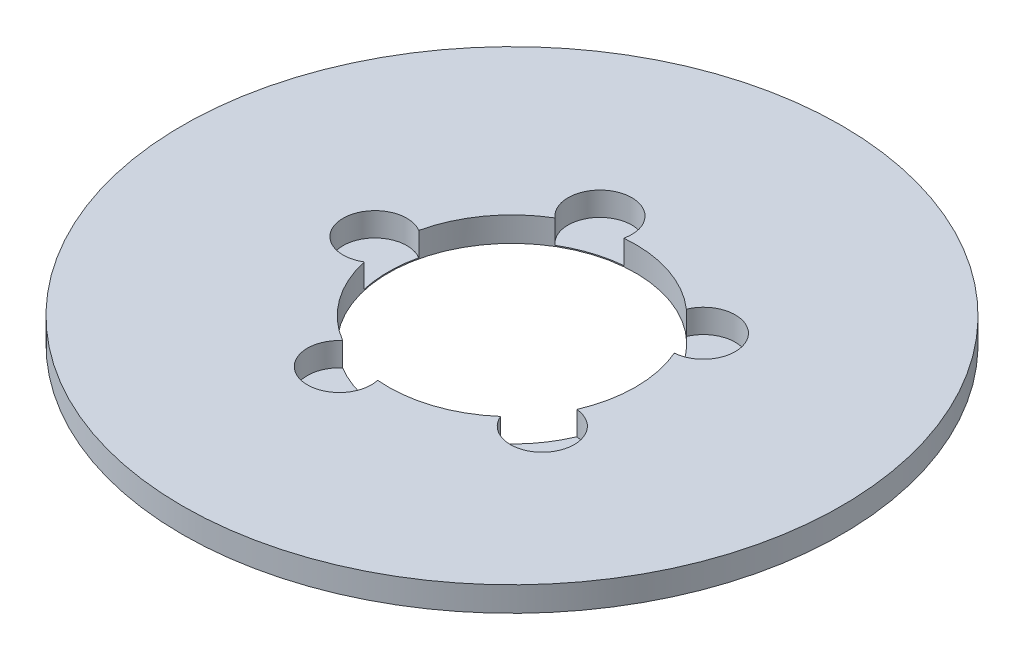
ISO-10303-21;
HEADER;
FILE_DESCRIPTION(('STEP AP214'),'2;1');
FILE_NAME('part.step','',(''),(''),'','','');
FILE_SCHEMA(('AUTOMOTIVE_DESIGN { 1 0 10303 214 1 1 1 1 }'));
ENDSEC;
DATA;
#1=APPLICATION_CONTEXT('core data for automotive mechanical design processes');
#2=APPLICATION_PROTOCOL_DEFINITION('international standard','automotive_design',2000,#1);
#3=PRODUCT_CONTEXT('',#1,'mechanical');
#4=PRODUCT('Part','Part','',(#3));
#5=PRODUCT_RELATED_PRODUCT_CATEGORY('part','',(#4));
#6=PRODUCT_DEFINITION_FORMATION('','',#4);
#7=PRODUCT_DEFINITION_CONTEXT('part definition',#1,'design');
#8=PRODUCT_DEFINITION('design','',#6,#7);
#9=PRODUCT_DEFINITION_SHAPE('','',#8);
#10=(LENGTH_UNIT() NAMED_UNIT(*) SI_UNIT(.MILLI.,.METRE.));
#11=(NAMED_UNIT(*) PLANE_ANGLE_UNIT() SI_UNIT($,.RADIAN.));
#12=(NAMED_UNIT(*) SI_UNIT($,.STERADIAN.) SOLID_ANGLE_UNIT());
#13=UNCERTAINTY_MEASURE_WITH_UNIT(LENGTH_MEASURE(1.E-05),#10,'distance_accuracy_value','');
#14=(GEOMETRIC_REPRESENTATION_CONTEXT(3) GLOBAL_UNCERTAINTY_ASSIGNED_CONTEXT((#13)) GLOBAL_UNIT_ASSIGNED_CONTEXT((#10,
#11,#12)) REPRESENTATION_CONTEXT('',''));
#15=CARTESIAN_POINT('',(0.,0.,0.));
#16=DIRECTION('',(0.,0.,1.));
#17=DIRECTION('',(1.,0.,0.));
#18=AXIS2_PLACEMENT_3D('',#15,#16,#17);
#19=CARTESIAN_POINT('',(0.,6.,0.));
#20=DIRECTION('',(0.,-1.,0.));
#21=DIRECTION('',(0.,0.,-1.));
#22=AXIS2_PLACEMENT_3D('',#19,#20,#21);
#23=CYLINDRICAL_SURFACE('',#22,80.);
#24=CARTESIAN_POINT('',(0.,6.,0.));
#25=DIRECTION('',(0.,1.,0.));
#26=DIRECTION('',(0.,0.,1.));
#27=AXIS2_PLACEMENT_3D('',#24,#25,#26);
#28=CIRCLE('',#27,80.);
#29=CARTESIAN_POINT('',(0.,6.,80.));
#30=VERTEX_POINT('',#29);
#31=EDGE_CURVE('E157',#30,#30,#28,.T.);
#32=ORIENTED_EDGE('',*,*,#31,.F.);
#33=EDGE_LOOP('',(#32));
#34=FACE_BOUND('',#33,.T.);
#35=CARTESIAN_POINT('',(0.,0.,0.));
#36=DIRECTION('',(0.,1.,0.));
#37=DIRECTION('',(0.,0.,1.));
#38=AXIS2_PLACEMENT_3D('',#35,#36,#37);
#39=CIRCLE('',#38,80.);
#40=CARTESIAN_POINT('',(0.,0.,80.));
#41=VERTEX_POINT('',#40);
#42=EDGE_CURVE('E150',#41,#41,#39,.T.);
#43=ORIENTED_EDGE('',*,*,#42,.T.);
#44=EDGE_LOOP('',(#43));
#45=FACE_BOUND('',#44,.T.);
#46=ADVANCED_FACE('F39',(#34,#45),#23,.T.);
#47=CARTESIAN_POINT('',(0.,6.,0.));
#48=DIRECTION('',(0.,1.,0.));
#49=DIRECTION('',(0.,0.,1.));
#50=AXIS2_PLACEMENT_3D('',#47,#48,#49);
#51=PLANE('',#50);
#52=CARTESIAN_POINT('',(-10.2781587726139,6.,-31.632920046946));
#53=DIRECTION('',(0.,1.,0.));
#54=DIRECTION('',(-0.95105651629515,0.,0.309016994374958));
#55=AXIS2_PLACEMENT_3D('',#52,#53,#54);
#56=CIRCLE('',#55,7.74053570405754);
#57=CARTESIAN_POINT('',(-2.73997250637277,6.,-29.8746138161537));
#58=VERTEX_POINT('',#57);
#59=CARTESIAN_POINT('',(-15.343173097293,6.,-25.7795857085894));
#60=VERTEX_POINT('',#59);
#61=EDGE_CURVE('E194',#58,#60,#56,.T.);
#62=ORIENTED_EDGE('',*,*,#61,.F.);
#63=CARTESIAN_POINT('',(0.,6.,0.));
#64=DIRECTION('',(0.,1.,0.));
#65=DIRECTION('',(0.,0.,1.));
#66=AXIS2_PLACEMENT_3D('',#63,#64,#65);
#67=CIRCLE('',#66,30.);
#68=CARTESIAN_POINT('',(19.7765417408433,6.,-22.5585548467246));
#69=VERTEX_POINT('',#68);
#70=EDGE_CURVE('E147',#69,#58,#67,.T.);
#71=ORIENTED_EDGE('',*,*,#70,.F.);
#72=CARTESIAN_POINT('',(26.90856900847,6.,-19.5502197524209));
#73=DIRECTION('',(0.,1.,0.));
#74=DIRECTION('',(-0.58778525229248,0.,-0.809016994374942));
#75=AXIS2_PLACEMENT_3D('',#72,#73,#74);
#76=CIRCLE('',#75,7.74053570405754);
#77=CARTESIAN_POINT('',(27.5657480730649,6.,-11.8376320762354));
#78=VERTEX_POINT('',#77);
#79=EDGE_CURVE('E254',#78,#69,#76,.T.);
#80=ORIENTED_EDGE('',*,*,#79,.F.);
#81=CARTESIAN_POINT('',(27.5657480730651,6.,11.837632076235));
#82=VERTEX_POINT('',#81);
#83=EDGE_CURVE('E144',#82,#78,#67,.T.);
#84=ORIENTED_EDGE('',*,*,#83,.F.);
#85=CARTESIAN_POINT('',(26.9085690084703,6.,19.5502197524205));
#86=DIRECTION('',(0.,1.,0.));
#87=DIRECTION('',(0.587785252292469,0.,-0.809016994374951));
#88=AXIS2_PLACEMENT_3D('',#85,#86,#87);
#89=CIRCLE('',#88,7.74053570405754);
#90=CARTESIAN_POINT('',(19.7765417408437,6.,22.5585548467243));
#91=VERTEX_POINT('',#90);
#92=EDGE_CURVE('E141',#91,#82,#89,.T.);
#93=ORIENTED_EDGE('',*,*,#92,.F.);
#94=CARTESIAN_POINT('',(-2.73997250637235,6.,29.8746138161537));
#95=VERTEX_POINT('',#94);
#96=EDGE_CURVE('E134',#95,#91,#67,.T.);
#97=ORIENTED_EDGE('',*,*,#96,.F.);
#98=CARTESIAN_POINT('',(-10.2781587726135,6.,31.6329200469462));
#99=DIRECTION('',(0.,1.,0.));
#100=DIRECTION('',(0.951056516295155,0.,0.309016994374945));
#101=AXIS2_PLACEMENT_3D('',#98,#99,#100);
#102=CIRCLE('',#101,7.74053570405754);
#103=CARTESIAN_POINT('',(-15.3431730972926,6.,25.7795857085896));
#104=VERTEX_POINT('',#103);
#105=EDGE_CURVE('E111',#104,#95,#102,.T.);
#106=ORIENTED_EDGE('',*,*,#105,.F.);
#107=CARTESIAN_POINT('',(-29.2591442102434,6.,6.62589466292503));
#108=VERTEX_POINT('',#107);
#109=EDGE_CURVE('E145',#108,#104,#67,.T.);
#110=ORIENTED_EDGE('',*,*,#109,.F.);
#111=CARTESIAN_POINT('',(-33.2608204717132,6.,0.));
#112=DIRECTION('',(0.,1.,0.));
#113=DIRECTION('',(0.,0.,1.));
#114=AXIS2_PLACEMENT_3D('',#111,#112,#113);
#115=CIRCLE('',#114,7.74053570405754);
#116=CARTESIAN_POINT('',(-29.2591442102434,6.,-6.62589466292503));
#117=VERTEX_POINT('',#116);
#118=EDGE_CURVE('E153',#117,#108,#115,.T.);
#119=ORIENTED_EDGE('',*,*,#118,.F.);
#120=EDGE_CURVE('E146',#60,#117,#67,.T.);
#121=ORIENTED_EDGE('',*,*,#120,.F.);
#122=EDGE_LOOP('',(#62,#71,#80,#84,#93,#97,#106,#110,#119,#121));
#123=FACE_BOUND('',#122,.T.);
#124=ORIENTED_EDGE('',*,*,#31,.T.);
#125=EDGE_LOOP('',(#124));
#126=FACE_BOUND('',#125,.T.);
#127=ADVANCED_FACE('F139',(#123,#126),#51,.T.);
#128=CARTESIAN_POINT('',(0.,0.,0.));
#129=DIRECTION('',(0.,1.,0.));
#130=DIRECTION('',(0.,0.,1.));
#131=AXIS2_PLACEMENT_3D('',#128,#129,#130);
#132=PLANE('',#131);
#133=CARTESIAN_POINT('',(0.,0.,0.));
#134=DIRECTION('',(0.,1.,0.));
#135=DIRECTION('',(0.,0.,1.));
#136=AXIS2_PLACEMENT_3D('',#133,#134,#135);
#137=CIRCLE('',#136,30.);
#138=CARTESIAN_POINT('',(0.,0.,30.));
#139=VERTEX_POINT('',#138);
#140=EDGE_CURVE('E154',#139,#139,#137,.T.);
#141=ORIENTED_EDGE('',*,*,#140,.T.);
#142=EDGE_LOOP('',(#141));
#143=FACE_BOUND('',#142,.T.);
#144=ORIENTED_EDGE('',*,*,#42,.F.);
#145=EDGE_LOOP('',(#144));
#146=FACE_BOUND('',#145,.T.);
#147=ADVANCED_FACE('F213',(#143,#146),#132,.F.);
#148=CARTESIAN_POINT('',(0.,6.,0.));
#149=DIRECTION('',(0.,-1.,0.));
#150=DIRECTION('',(0.,0.,-1.));
#151=AXIS2_PLACEMENT_3D('',#148,#149,#150);
#152=CYLINDRICAL_SURFACE('',#151,30.);
#153=DIRECTION('',(0.,1.,0.));
#154=VECTOR('',#153,1.);
#155=CARTESIAN_POINT('',(-2.73997250637277,3.12236364323344,-29.8746138161537));
#156=LINE('',#155,#154);
#157=CARTESIAN_POINT('',(-2.73997250637277,0.244727286466882,-29.8746138161537));
#158=VERTEX_POINT('',#157);
#159=EDGE_CURVE('E11',#158,#58,#156,.T.);
#160=ORIENTED_EDGE('',*,*,#159,.F.);
#161=CARTESIAN_POINT('',(0.,0.244727286466882,0.));
#162=DIRECTION('',(0.,1.,0.));
#163=DIRECTION('',(0.,0.,1.));
#164=AXIS2_PLACEMENT_3D('',#161,#162,#163);
#165=CIRCLE('',#164,30.);
#166=CARTESIAN_POINT('',(-15.343173097293,0.244727286466882,-25.7795857085894));
#167=VERTEX_POINT('',#166);
#168=EDGE_CURVE('E189',#158,#167,#165,.T.);
#169=ORIENTED_EDGE('',*,*,#168,.T.);
#170=DIRECTION('',(0.,1.,0.));
#171=VECTOR('',#170,1.);
#172=CARTESIAN_POINT('',(-15.343173097293,3.12236364323344,-25.7795857085894));
#173=LINE('',#172,#171);
#174=EDGE_CURVE('E46',#60,#167,#173,.F.);
#175=ORIENTED_EDGE('',*,*,#174,.F.);
#176=ORIENTED_EDGE('',*,*,#120,.T.);
#177=DIRECTION('',(0.,1.,0.));
#178=VECTOR('',#177,1.);
#179=CARTESIAN_POINT('',(-29.2591442102434,3.12236364323344,-6.62589466292504));
#180=LINE('',#179,#178);
#181=CARTESIAN_POINT('',(-29.2591442102434,0.244727286466882,-6.62589466292503));
#182=VERTEX_POINT('',#181);
#183=EDGE_CURVE('E168',#182,#117,#180,.T.);
#184=ORIENTED_EDGE('',*,*,#183,.F.);
#185=CARTESIAN_POINT('',(0.,0.244727286466882,0.));
#186=DIRECTION('',(0.,1.,0.));
#187=DIRECTION('',(0.,0.,1.));
#188=AXIS2_PLACEMENT_3D('',#185,#186,#187);
#189=CIRCLE('',#188,30.);
#190=CARTESIAN_POINT('',(-29.2591442102434,0.244727286466882,6.62589466292503));
#191=VERTEX_POINT('',#190);
#192=EDGE_CURVE('E165',#182,#191,#189,.T.);
#193=ORIENTED_EDGE('',*,*,#192,.T.);
#194=DIRECTION('',(0.,1.,0.));
#195=VECTOR('',#194,1.);
#196=CARTESIAN_POINT('',(-29.2591442102434,3.12236364323344,6.62589466292504));
#197=LINE('',#196,#195);
#198=EDGE_CURVE('E170',#108,#191,#197,.F.);
#199=ORIENTED_EDGE('',*,*,#198,.F.);
#200=ORIENTED_EDGE('',*,*,#109,.T.);
#201=DIRECTION('',(0.,1.,0.));
#202=VECTOR('',#201,1.);
#203=CARTESIAN_POINT('',(-15.3431730972926,3.12236364323344,25.7795857085896));
#204=LINE('',#203,#202);
#205=CARTESIAN_POINT('',(-15.3431730972926,0.244727286466882,25.7795857085896));
#206=VERTEX_POINT('',#205);
#207=EDGE_CURVE('E121',#206,#104,#204,.T.);
#208=ORIENTED_EDGE('',*,*,#207,.F.);
#209=CARTESIAN_POINT('',(0.,0.244727286466882,0.));
#210=DIRECTION('',(0.,1.,0.));
#211=DIRECTION('',(0.,0.,1.));
#212=AXIS2_PLACEMENT_3D('',#209,#210,#211);
#213=CIRCLE('',#212,30.);
#214=CARTESIAN_POINT('',(-2.73997250637235,0.244727286466882,29.8746138161537));
#215=VERTEX_POINT('',#214);
#216=EDGE_CURVE('E136',#206,#215,#213,.T.);
#217=ORIENTED_EDGE('',*,*,#216,.T.);
#218=DIRECTION('',(0.,1.,0.));
#219=VECTOR('',#218,1.);
#220=CARTESIAN_POINT('',(-2.73997250637235,3.12236364323344,29.8746138161537));
#221=LINE('',#220,#219);
#222=EDGE_CURVE('E117',#95,#215,#221,.F.);
#223=ORIENTED_EDGE('',*,*,#222,.F.);
#224=ORIENTED_EDGE('',*,*,#96,.T.);
#225=DIRECTION('',(0.,1.,0.));
#226=VECTOR('',#225,1.);
#227=CARTESIAN_POINT('',(19.7765417408437,3.12236364323344,22.5585548467243));
#228=LINE('',#227,#226);
#229=CARTESIAN_POINT('',(19.7765417408437,0.244727286466882,22.5585548467243));
#230=VERTEX_POINT('',#229);
#231=EDGE_CURVE('E182',#230,#91,#228,.T.);
#232=ORIENTED_EDGE('',*,*,#231,.F.);
#233=CARTESIAN_POINT('',(0.,0.244727286466882,0.));
#234=DIRECTION('',(0.,1.,0.));
#235=DIRECTION('',(0.,0.,1.));
#236=AXIS2_PLACEMENT_3D('',#233,#234,#235);
#237=CIRCLE('',#236,30.);
#238=CARTESIAN_POINT('',(27.5657480730651,0.244727286466882,11.837632076235));
#239=VERTEX_POINT('',#238);
#240=EDGE_CURVE('E174',#230,#239,#237,.T.);
#241=ORIENTED_EDGE('',*,*,#240,.T.);
#242=DIRECTION('',(0.,1.,0.));
#243=VECTOR('',#242,1.);
#244=CARTESIAN_POINT('',(27.5657480730651,3.12236364323344,11.837632076235));
#245=LINE('',#244,#243);
#246=EDGE_CURVE('E177',#82,#239,#245,.F.);
#247=ORIENTED_EDGE('',*,*,#246,.F.);
#248=ORIENTED_EDGE('',*,*,#83,.T.);
#249=DIRECTION('',(0.,1.,0.));
#250=VECTOR('',#249,1.);
#251=CARTESIAN_POINT('',(27.5657480730649,3.12236364323344,-11.8376320762354));
#252=LINE('',#251,#250);
#253=CARTESIAN_POINT('',(27.5657480730649,0.244727286466882,-11.8376320762354));
#254=VERTEX_POINT('',#253);
#255=EDGE_CURVE('E187',#254,#78,#252,.T.);
#256=ORIENTED_EDGE('',*,*,#255,.F.);
#257=CARTESIAN_POINT('',(0.,0.244727286466882,0.));
#258=DIRECTION('',(0.,1.,0.));
#259=DIRECTION('',(0.,0.,1.));
#260=AXIS2_PLACEMENT_3D('',#257,#258,#259);
#261=CIRCLE('',#260,30.);
#262=CARTESIAN_POINT('',(19.7765417408433,0.244727286466882,-22.5585548467246));
#263=VERTEX_POINT('',#262);
#264=EDGE_CURVE('E181',#254,#263,#261,.T.);
#265=ORIENTED_EDGE('',*,*,#264,.T.);
#266=DIRECTION('',(0.,1.,0.));
#267=VECTOR('',#266,1.);
#268=CARTESIAN_POINT('',(19.7765417408433,3.12236364323344,-22.5585548467246));
#269=LINE('',#268,#267);
#270=EDGE_CURVE('E186',#69,#263,#269,.F.);
#271=ORIENTED_EDGE('',*,*,#270,.F.);
#272=ORIENTED_EDGE('',*,*,#70,.T.);
#273=EDGE_LOOP('',(#160,#169,#175,#176,#184,#193,#199,#200,#208,#217,#223,#224,#232,#241,#247,
#248,#256,#265,#271,#272));
#274=FACE_BOUND('',#273,.T.);
#275=ORIENTED_EDGE('',*,*,#140,.F.);
#276=EDGE_LOOP('',(#275));
#277=FACE_BOUND('',#276,.T.);
#278=ADVANCED_FACE('F135',(#274,#277),#152,.F.);
#279=CARTESIAN_POINT('',(-33.2608204717132,0.244727286466882,0.));
#280=DIRECTION('',(0.,1.,0.));
#281=DIRECTION('',(0.,0.,1.));
#282=AXIS2_PLACEMENT_3D('',#279,#280,#281);
#283=CYLINDRICAL_SURFACE('',#282,7.74053570405754);
#284=ORIENTED_EDGE('',*,*,#183,.T.);
#285=ORIENTED_EDGE('',*,*,#118,.T.);
#286=ORIENTED_EDGE('',*,*,#198,.T.);
#287=CARTESIAN_POINT('',(-33.2608204717132,0.244727286466882,0.));
#288=DIRECTION('',(0.,1.,0.));
#289=DIRECTION('',(0.,0.,1.));
#290=AXIS2_PLACEMENT_3D('',#287,#288,#289);
#291=CIRCLE('',#290,7.74053570405754);
#292=EDGE_CURVE('E158',#182,#191,#291,.T.);
#293=ORIENTED_EDGE('',*,*,#292,.F.);
#294=EDGE_LOOP('',(#284,#285,#286,#293));
#295=FACE_BOUND('',#294,.T.);
#296=ADVANCED_FACE('F221',(#295),#283,.F.);
#297=CARTESIAN_POINT('',(-33.2608204717132,0.244727286466882,0.));
#298=DIRECTION('',(0.,1.,0.));
#299=DIRECTION('',(0.,0.,1.));
#300=AXIS2_PLACEMENT_3D('',#297,#298,#299);
#301=PLANE('',#300);
#302=ORIENTED_EDGE('',*,*,#292,.T.);
#303=ORIENTED_EDGE('',*,*,#192,.F.);
#304=EDGE_LOOP('',(#302,#303));
#305=FACE_BOUND('',#304,.T.);
#306=ADVANCED_FACE('F227',(#305),#301,.T.);
#307=CARTESIAN_POINT('',(-10.2781587726135,0.244727286466882,31.6329200469462));
#308=DIRECTION('',(0.,1.,0.));
#309=DIRECTION('',(0.,0.,1.));
#310=AXIS2_PLACEMENT_3D('',#307,#308,#309);
#311=CYLINDRICAL_SURFACE('',#310,7.74053570405754);
#312=ORIENTED_EDGE('',*,*,#207,.T.);
#313=ORIENTED_EDGE('',*,*,#105,.T.);
#314=ORIENTED_EDGE('',*,*,#222,.T.);
#315=CARTESIAN_POINT('',(-10.2781587726135,0.244727286466882,31.6329200469462));
#316=DIRECTION('',(0.,1.,0.));
#317=DIRECTION('',(0.951056516295155,0.,0.309016994374945));
#318=AXIS2_PLACEMENT_3D('',#315,#316,#317);
#319=CIRCLE('',#318,7.74053570405754);
#320=EDGE_CURVE('E127',#206,#215,#319,.T.);
#321=ORIENTED_EDGE('',*,*,#320,.F.);
#322=EDGE_LOOP('',(#312,#313,#314,#321));
#323=FACE_BOUND('',#322,.T.);
#324=ADVANCED_FACE('F116',(#323),#311,.F.);
#325=CARTESIAN_POINT('',(-10.2781587726135,0.244727286466882,31.6329200469462));
#326=DIRECTION('',(0.,1.,0.));
#327=DIRECTION('',(0.951056516295155,0.,0.309016994374945));
#328=AXIS2_PLACEMENT_3D('',#325,#326,#327);
#329=PLANE('',#328);
#330=ORIENTED_EDGE('',*,*,#320,.T.);
#331=ORIENTED_EDGE('',*,*,#216,.F.);
#332=EDGE_LOOP('',(#330,#331));
#333=FACE_BOUND('',#332,.T.);
#334=ADVANCED_FACE('F234',(#333),#329,.T.);
#335=CARTESIAN_POINT('',(26.9085690084703,0.244727286466882,19.5502197524205));
#336=DIRECTION('',(0.,1.,0.));
#337=DIRECTION('',(0.,0.,1.));
#338=AXIS2_PLACEMENT_3D('',#335,#336,#337);
#339=CYLINDRICAL_SURFACE('',#338,7.74053570405754);
#340=ORIENTED_EDGE('',*,*,#231,.T.);
#341=ORIENTED_EDGE('',*,*,#92,.T.);
#342=ORIENTED_EDGE('',*,*,#246,.T.);
#343=CARTESIAN_POINT('',(26.9085690084703,0.244727286466882,19.5502197524205));
#344=DIRECTION('',(0.,1.,0.));
#345=DIRECTION('',(0.587785252292469,0.,-0.809016994374951));
#346=AXIS2_PLACEMENT_3D('',#343,#344,#345);
#347=CIRCLE('',#346,7.74053570405754);
#348=EDGE_CURVE('E130',#230,#239,#347,.T.);
#349=ORIENTED_EDGE('',*,*,#348,.F.);
#350=EDGE_LOOP('',(#340,#341,#342,#349));
#351=FACE_BOUND('',#350,.T.);
#352=ADVANCED_FACE('F240',(#351),#339,.F.);
#353=CARTESIAN_POINT('',(26.9085690084703,0.244727286466882,19.5502197524205));
#354=DIRECTION('',(0.,1.,0.));
#355=DIRECTION('',(0.587785252292469,0.,-0.809016994374951));
#356=AXIS2_PLACEMENT_3D('',#353,#354,#355);
#357=PLANE('',#356);
#358=ORIENTED_EDGE('',*,*,#348,.T.);
#359=ORIENTED_EDGE('',*,*,#240,.F.);
#360=EDGE_LOOP('',(#358,#359));
#361=FACE_BOUND('',#360,.T.);
#362=ADVANCED_FACE('F245',(#361),#357,.T.);
#363=CARTESIAN_POINT('',(26.90856900847,0.244727286466882,-19.5502197524209));
#364=DIRECTION('',(0.,1.,0.));
#365=DIRECTION('',(0.,0.,1.));
#366=AXIS2_PLACEMENT_3D('',#363,#364,#365);
#367=CYLINDRICAL_SURFACE('',#366,7.74053570405754);
#368=ORIENTED_EDGE('',*,*,#255,.T.);
#369=ORIENTED_EDGE('',*,*,#79,.T.);
#370=ORIENTED_EDGE('',*,*,#270,.T.);
#371=CARTESIAN_POINT('',(26.90856900847,0.244727286466882,-19.5502197524209));
#372=DIRECTION('',(0.,1.,0.));
#373=DIRECTION('',(-0.58778525229248,0.,-0.809016994374942));
#374=AXIS2_PLACEMENT_3D('',#371,#372,#373);
#375=CIRCLE('',#374,7.74053570405754);
#376=EDGE_CURVE('E56',#254,#263,#375,.T.);
#377=ORIENTED_EDGE('',*,*,#376,.F.);
#378=EDGE_LOOP('',(#368,#369,#370,#377));
#379=FACE_BOUND('',#378,.T.);
#380=ADVANCED_FACE('F266',(#379),#367,.F.);
#381=CARTESIAN_POINT('',(26.90856900847,0.244727286466882,-19.5502197524209));
#382=DIRECTION('',(0.,1.,0.));
#383=DIRECTION('',(-0.58778525229248,0.,-0.809016994374942));
#384=AXIS2_PLACEMENT_3D('',#381,#382,#383);
#385=PLANE('',#384);
#386=ORIENTED_EDGE('',*,*,#376,.T.);
#387=ORIENTED_EDGE('',*,*,#264,.F.);
#388=EDGE_LOOP('',(#386,#387));
#389=FACE_BOUND('',#388,.T.);
#390=ADVANCED_FACE('F204',(#389),#385,.T.);
#391=CARTESIAN_POINT('',(-10.2781587726139,0.244727286466882,-31.632920046946));
#392=DIRECTION('',(0.,1.,0.));
#393=DIRECTION('',(0.,0.,1.));
#394=AXIS2_PLACEMENT_3D('',#391,#392,#393);
#395=CYLINDRICAL_SURFACE('',#394,7.74053570405754);
#396=ORIENTED_EDGE('',*,*,#159,.T.);
#397=ORIENTED_EDGE('',*,*,#61,.T.);
#398=ORIENTED_EDGE('',*,*,#174,.T.);
#399=CARTESIAN_POINT('',(-10.2781587726139,0.244727286466882,-31.632920046946));
#400=DIRECTION('',(0.,1.,0.));
#401=DIRECTION('',(-0.95105651629515,0.,0.309016994374958));
#402=AXIS2_PLACEMENT_3D('',#399,#400,#401);
#403=CIRCLE('',#402,7.74053570405754);
#404=EDGE_CURVE('E55',#158,#167,#403,.T.);
#405=ORIENTED_EDGE('',*,*,#404,.F.);
#406=EDGE_LOOP('',(#396,#397,#398,#405));
#407=FACE_BOUND('',#406,.T.);
#408=ADVANCED_FACE('F193',(#407),#395,.F.);
#409=CARTESIAN_POINT('',(-10.2781587726139,0.244727286466882,-31.632920046946));
#410=DIRECTION('',(0.,1.,0.));
#411=DIRECTION('',(-0.95105651629515,0.,0.309016994374958));
#412=AXIS2_PLACEMENT_3D('',#409,#410,#411);
#413=PLANE('',#412);
#414=ORIENTED_EDGE('',*,*,#404,.T.);
#415=ORIENTED_EDGE('',*,*,#168,.F.);
#416=EDGE_LOOP('',(#414,#415));
#417=FACE_BOUND('',#416,.T.);
#418=ADVANCED_FACE('F196',(#417),#413,.T.);
#419=CLOSED_SHELL('',(#46,#127,#147,#278,#296,#306,#324,#334,#352,#362,#380,#390,#408,#418));
#420=MANIFOLD_SOLID_BREP('B2',#419);
#421=ADVANCED_BREP_SHAPE_REPRESENTATION('',(#18,#420),#14);
#422=SHAPE_DEFINITION_REPRESENTATION(#9,#421);
ENDSEC;
END-ISO-10303-21;
